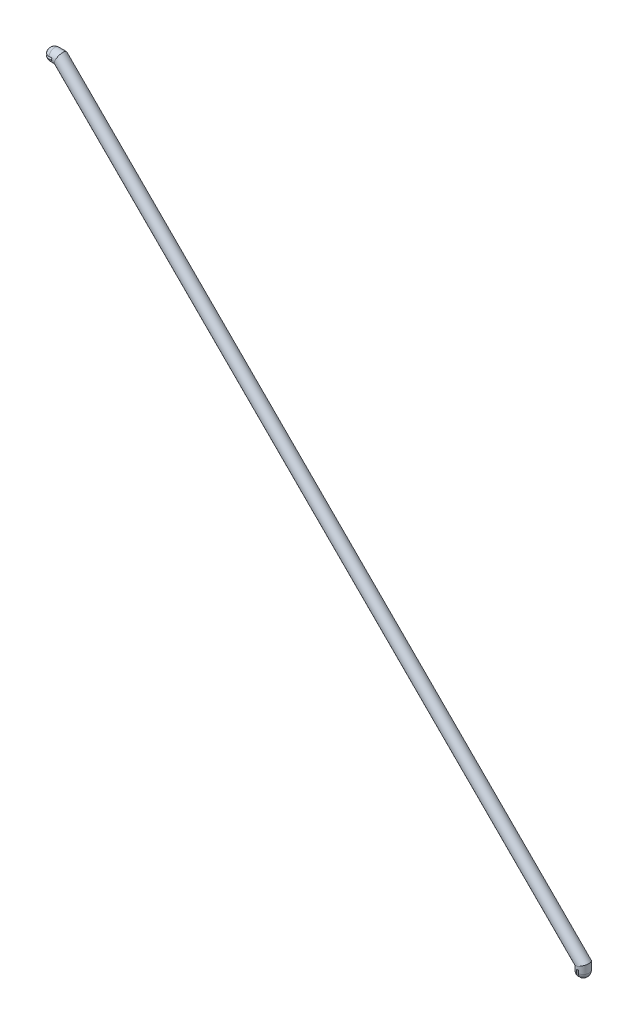
ISO-10303-21;
HEADER;
FILE_DESCRIPTION(('STEP AP214'),'2;1');
FILE_NAME('part.step','',(''),(''),'','','');
FILE_SCHEMA(('AUTOMOTIVE_DESIGN { 1 0 10303 214 1 1 1 1 }'));
ENDSEC;
DATA;
#1=APPLICATION_CONTEXT('core data for automotive mechanical design processes');
#2=APPLICATION_PROTOCOL_DEFINITION('international standard','automotive_design',2000,#1);
#3=PRODUCT_CONTEXT('',#1,'mechanical');
#4=PRODUCT('Part','Part','',(#3));
#5=PRODUCT_RELATED_PRODUCT_CATEGORY('part','',(#4));
#6=PRODUCT_DEFINITION_FORMATION('','',#4);
#7=PRODUCT_DEFINITION_CONTEXT('part definition',#1,'design');
#8=PRODUCT_DEFINITION('design','',#6,#7);
#9=PRODUCT_DEFINITION_SHAPE('','',#8);
#10=(LENGTH_UNIT() NAMED_UNIT(*) SI_UNIT(.MILLI.,.METRE.));
#11=(NAMED_UNIT(*) PLANE_ANGLE_UNIT() SI_UNIT($,.RADIAN.));
#12=(NAMED_UNIT(*) SI_UNIT($,.STERADIAN.) SOLID_ANGLE_UNIT());
#13=UNCERTAINTY_MEASURE_WITH_UNIT(LENGTH_MEASURE(1.E-05),#10,'distance_accuracy_value','');
#14=(GEOMETRIC_REPRESENTATION_CONTEXT(3) GLOBAL_UNCERTAINTY_ASSIGNED_CONTEXT((#13)) GLOBAL_UNIT_ASSIGNED_CONTEXT((#10,
#11,#12)) REPRESENTATION_CONTEXT('',''));
#15=CARTESIAN_POINT('',(0.,0.,0.));
#16=DIRECTION('',(0.,0.,1.));
#17=DIRECTION('',(1.,0.,0.));
#18=AXIS2_PLACEMENT_3D('',#15,#16,#17);
#19=CARTESIAN_POINT('',(-181.381279792797,177.381279792793,0.));
#20=DIRECTION('',(1.,0.,0.));
#21=DIRECTION('',(0.,1.,0.));
#22=AXIS2_PLACEMENT_3D('',#19,#20,#21);
#23=CYLINDRICAL_SURFACE('',#22,4.);
#24=CARTESIAN_POINT('',(-177.381279792798,177.381279792793,0.));
#25=DIRECTION('',(0.923879532511289,-0.382683432365085,0.));
#26=DIRECTION('',(0.382683432365085,0.923879532511289,0.));
#27=AXIS2_PLACEMENT_3D('',#24,#25,#26);
#28=ELLIPSE('',#27,4.32956880116954,4.);
#29=CARTESIAN_POINT('',(-175.724425543306,181.381279792793,0.));
#30=VERTEX_POINT('',#29);
#31=EDGE_CURVE('E163',#30,#30,#28,.T.);
#32=ORIENTED_EDGE('',*,*,#31,.F.);
#33=EDGE_LOOP('',(#32));
#34=FACE_BOUND('',#33,.T.);
#35=DIRECTION('',(1.,0.,0.));
#36=VECTOR('',#35,1.);
#37=CARTESIAN_POINT('',(-181.381279792797,178.131279792791,3.92905841137596));
#38=LINE('',#37,#36);
#39=CARTESIAN_POINT('',(-179.381279792798,178.131279792791,3.92905841137594));
#40=VERTEX_POINT('',#39);
#41=CARTESIAN_POINT('',(-181.381279792797,178.131279792791,3.92905841137569));
#42=VERTEX_POINT('',#41);
#43=EDGE_CURVE('E108',#40,#42,#38,.F.);
#44=ORIENTED_EDGE('',*,*,#43,.F.);
#45=CARTESIAN_POINT('',(-179.381279792798,177.381279792793,0.));
#46=DIRECTION('',(-1.,0.,0.));
#47=DIRECTION('',(0.,-1.,0.));
#48=AXIS2_PLACEMENT_3D('',#45,#46,#47);
#49=CIRCLE('',#48,4.);
#50=CARTESIAN_POINT('',(-179.381279792798,176.631279792791,3.92905841137492));
#51=VERTEX_POINT('',#50);
#52=EDGE_CURVE('E11',#51,#40,#49,.T.);
#53=ORIENTED_EDGE('',*,*,#52,.F.);
#54=DIRECTION('',(1.,0.,0.));
#55=VECTOR('',#54,1.);
#56=CARTESIAN_POINT('',(-181.381279792797,176.631279792791,3.9290584113749));
#57=LINE('',#56,#55);
#58=CARTESIAN_POINT('',(-181.381279792797,176.631279792791,3.92905841137517));
#59=VERTEX_POINT('',#58);
#60=EDGE_CURVE('E105',#59,#51,#57,.T.);
#61=ORIENTED_EDGE('',*,*,#60,.F.);
#62=CARTESIAN_POINT('',(-181.381279792797,177.381279792793,0.));
#63=DIRECTION('',(-1.,0.,0.));
#64=DIRECTION('',(0.,-1.,0.));
#65=AXIS2_PLACEMENT_3D('',#62,#63,#64);
#66=CIRCLE('',#65,4.);
#67=CARTESIAN_POINT('',(-181.381279792797,176.631279792791,-3.92905841137517));
#68=VERTEX_POINT('',#67);
#69=EDGE_CURVE('E159',#68,#59,#66,.T.);
#70=ORIENTED_EDGE('',*,*,#69,.F.);
#71=DIRECTION('',(1.,0.,0.));
#72=VECTOR('',#71,1.);
#73=CARTESIAN_POINT('',(-181.381279792797,176.631279792791,-3.9290584113749));
#74=LINE('',#73,#72);
#75=CARTESIAN_POINT('',(-179.381279792798,176.631279792791,-3.92905841137492));
#76=VERTEX_POINT('',#75);
#77=EDGE_CURVE('E52',#76,#68,#74,.F.);
#78=ORIENTED_EDGE('',*,*,#77,.F.);
#79=CARTESIAN_POINT('',(-179.381279792798,178.131279792791,-3.92905841137594));
#80=VERTEX_POINT('',#79);
#81=EDGE_CURVE('E45',#80,#76,#49,.T.);
#82=ORIENTED_EDGE('',*,*,#81,.F.);
#83=DIRECTION('',(1.,0.,0.));
#84=VECTOR('',#83,1.);
#85=CARTESIAN_POINT('',(-181.381279792797,178.131279792791,-3.92905841137596));
#86=LINE('',#85,#84);
#87=CARTESIAN_POINT('',(-181.381279792797,178.131279792791,-3.92905841137569));
#88=VERTEX_POINT('',#87);
#89=EDGE_CURVE('E126',#88,#80,#86,.T.);
#90=ORIENTED_EDGE('',*,*,#89,.F.);
#91=EDGE_CURVE('E161',#42,#88,#66,.T.);
#92=ORIENTED_EDGE('',*,*,#91,.F.);
#93=EDGE_LOOP('',(#44,#53,#61,#70,#78,#82,#90,#92));
#94=FACE_BOUND('',#93,.T.);
#95=ADVANCED_FACE('F36',(#34,#94),#23,.T.);
#96=CARTESIAN_POINT('',(-181.381279792798,177.381279792791,0.));
#97=DIRECTION('',(0.,0.,1.));
#98=DIRECTION('',(0.,-1.,0.));
#99=AXIS2_PLACEMENT_3D('',#96,#97,#98);
#100=SPHERICAL_SURFACE('',#99,4.);
#101=CARTESIAN_POINT('',(-181.381279792798,178.131279792791,0.));
#102=DIRECTION('',(0.,-1.,0.));
#103=DIRECTION('',(1.,0.,0.));
#104=AXIS2_PLACEMENT_3D('',#101,#102,#103);
#105=CIRCLE('',#104,3.92905841137543);
#106=EDGE_CURVE('E179',#42,#88,#105,.T.);
#107=ORIENTED_EDGE('',*,*,#106,.F.);
#108=ORIENTED_EDGE('',*,*,#91,.T.);
#109=EDGE_LOOP('',(#107,#108));
#110=FACE_BOUND('',#109,.T.);
#111=ADVANCED_FACE('F186',(#110),#100,.T.);
#112=CARTESIAN_POINT('',(-181.381279792798,176.631279792791,0.));
#113=DIRECTION('',(0.,1.,0.));
#114=DIRECTION('',(-1.,0.,0.));
#115=AXIS2_PLACEMENT_3D('',#112,#113,#114);
#116=CIRCLE('',#115,3.92905841137544);
#117=EDGE_CURVE('E115',#68,#59,#116,.T.);
#118=ORIENTED_EDGE('',*,*,#117,.F.);
#119=ORIENTED_EDGE('',*,*,#69,.T.);
#120=EDGE_LOOP('',(#118,#119));
#121=FACE_BOUND('',#120,.T.);
#122=ADVANCED_FACE('F188',(#121),#100,.T.);
#123=CARTESIAN_POINT('',(177.381279792799,-181.38127979279,0.));
#124=DIRECTION('',(0.,0.,1.));
#125=DIRECTION('',(-1.,0.,0.));
#126=AXIS2_PLACEMENT_3D('',#123,#124,#125);
#127=SPHERICAL_SURFACE('',#126,4.);
#128=CARTESIAN_POINT('',(177.381279792799,-181.38127979279,0.));
#129=DIRECTION('',(0.,1.,0.));
#130=DIRECTION('',(-1.,0.,0.));
#131=AXIS2_PLACEMENT_3D('',#128,#129,#130);
#132=CIRCLE('',#131,4.);
#133=CARTESIAN_POINT('',(178.131279792799,-181.38127979279,3.92905841137543));
#134=VERTEX_POINT('',#133);
#135=CARTESIAN_POINT('',(178.131279792799,-181.38127979279,-3.92905841137543));
#136=VERTEX_POINT('',#135);
#137=EDGE_CURVE('E158',#134,#136,#132,.T.);
#138=ORIENTED_EDGE('',*,*,#137,.F.);
#139=CARTESIAN_POINT('',(178.131279792799,-181.38127979279,0.));
#140=DIRECTION('',(1.,0.,0.));
#141=DIRECTION('',(0.,1.,0.));
#142=AXIS2_PLACEMENT_3D('',#139,#140,#141);
#143=CIRCLE('',#142,3.92905841137543);
#144=EDGE_CURVE('E170',#134,#136,#143,.T.);
#145=ORIENTED_EDGE('',*,*,#144,.T.);
#146=EDGE_LOOP('',(#138,#145));
#147=FACE_BOUND('',#146,.T.);
#148=ADVANCED_FACE('F194',(#147),#127,.T.);
#149=CARTESIAN_POINT('',(177.381279792799,-175.458740118349,0.));
#150=DIRECTION('',(0.,-1.,0.));
#151=DIRECTION('',(1.,0.,0.));
#152=AXIS2_PLACEMENT_3D('',#149,#150,#151);
#153=CYLINDRICAL_SURFACE('',#152,4.);
#154=CARTESIAN_POINT('',(177.381279792799,-179.38127979279,0.));
#155=DIRECTION('',(0.,-1.,0.));
#156=DIRECTION('',(0.,0.,-1.));
#157=AXIS2_PLACEMENT_3D('',#154,#155,#156);
#158=CIRCLE('',#157,4.);
#159=CARTESIAN_POINT('',(178.131279792799,-179.38127979279,3.92905841137542));
#160=VERTEX_POINT('',#159);
#161=CARTESIAN_POINT('',(176.631279792799,-179.38127979279,3.92905841137543));
#162=VERTEX_POINT('',#161);
#163=EDGE_CURVE('E175',#160,#162,#158,.T.);
#164=ORIENTED_EDGE('',*,*,#163,.F.);
#165=DIRECTION('',(0.,-1.,0.));
#166=VECTOR('',#165,1.);
#167=CARTESIAN_POINT('',(178.131279792799,-175.458740118349,3.92905841137543));
#168=LINE('',#167,#166);
#169=EDGE_CURVE('E152',#160,#134,#168,.T.);
#170=ORIENTED_EDGE('',*,*,#169,.T.);
#171=ORIENTED_EDGE('',*,*,#137,.T.);
#172=DIRECTION('',(0.,-1.,0.));
#173=VECTOR('',#172,1.);
#174=CARTESIAN_POINT('',(178.131279792799,-175.458740118349,-3.92905841137543));
#175=LINE('',#174,#173);
#176=CARTESIAN_POINT('',(178.131279792799,-179.38127979279,-3.92905841137542));
#177=VERTEX_POINT('',#176);
#178=EDGE_CURVE('E149',#136,#177,#175,.F.);
#179=ORIENTED_EDGE('',*,*,#178,.T.);
#180=CARTESIAN_POINT('',(176.631279792799,-179.38127979279,-3.92905841137543));
#181=VERTEX_POINT('',#180);
#182=EDGE_CURVE('E173',#181,#177,#158,.T.);
#183=ORIENTED_EDGE('',*,*,#182,.F.);
#184=DIRECTION('',(0.,-1.,0.));
#185=VECTOR('',#184,1.);
#186=CARTESIAN_POINT('',(176.631279792799,-175.458740118349,-3.92905841137543));
#187=LINE('',#186,#185);
#188=CARTESIAN_POINT('',(176.631279792799,-181.38127979279,-3.92905841137544));
#189=VERTEX_POINT('',#188);
#190=EDGE_CURVE('E146',#181,#189,#187,.T.);
#191=ORIENTED_EDGE('',*,*,#190,.T.);
#192=CARTESIAN_POINT('',(176.631279792799,-181.38127979279,3.92905841137544));
#193=VERTEX_POINT('',#192);
#194=EDGE_CURVE('E155',#189,#193,#132,.T.);
#195=ORIENTED_EDGE('',*,*,#194,.T.);
#196=DIRECTION('',(0.,-1.,0.));
#197=VECTOR('',#196,1.);
#198=CARTESIAN_POINT('',(176.631279792799,-175.458740118349,3.92905841137543));
#199=LINE('',#198,#197);
#200=EDGE_CURVE('E60',#193,#162,#199,.F.);
#201=ORIENTED_EDGE('',*,*,#200,.T.);
#202=EDGE_LOOP('',(#164,#170,#171,#179,#183,#191,#195,#201));
#203=FACE_BOUND('',#202,.T.);
#204=CARTESIAN_POINT('',(177.381279792799,-177.381279792791,0.));
#205=DIRECTION('',(0.382683432365097,-0.923879532511284,0.));
#206=DIRECTION('',(0.923879532511284,0.382683432365097,0.));
#207=AXIS2_PLACEMENT_3D('',#204,#205,#206);
#208=ELLIPSE('',#207,4.3295688011696,4.);
#209=CARTESIAN_POINT('',(181.381279792799,-175.724425543298,0.));
#210=VERTEX_POINT('',#209);
#211=EDGE_CURVE('E162',#210,#210,#208,.T.);
#212=ORIENTED_EDGE('',*,*,#211,.T.);
#213=EDGE_LOOP('',(#212));
#214=FACE_BOUND('',#213,.T.);
#215=ADVANCED_FACE('F38',(#203,#214),#153,.T.);
#216=CARTESIAN_POINT('',(-178.740720633697,178.740720633689,0.));
#217=DIRECTION('',(0.707106781186564,-0.707106781186531,0.));
#218=DIRECTION('',(0.707106781186531,0.707106781186564,0.));
#219=AXIS2_PLACEMENT_3D('',#216,#217,#218);
#220=CYLINDRICAL_SURFACE('',#219,4.);
#221=ORIENTED_EDGE('',*,*,#31,.T.);
#222=EDGE_LOOP('',(#221));
#223=FACE_BOUND('',#222,.T.);
#224=ORIENTED_EDGE('',*,*,#211,.F.);
#225=EDGE_LOOP('',(#224));
#226=FACE_BOUND('',#225,.T.);
#227=ADVANCED_FACE('F228',(#223,#226),#220,.T.);
#228=ORIENTED_EDGE('',*,*,#194,.F.);
#229=CARTESIAN_POINT('',(176.631279792799,-181.38127979279,0.));
#230=DIRECTION('',(-1.,0.,0.));
#231=DIRECTION('',(0.,-1.,0.));
#232=AXIS2_PLACEMENT_3D('',#229,#230,#231);
#233=CIRCLE('',#232,3.92905841137544);
#234=EDGE_CURVE('E166',#189,#193,#233,.T.);
#235=ORIENTED_EDGE('',*,*,#234,.T.);
#236=EDGE_LOOP('',(#228,#235));
#237=FACE_BOUND('',#236,.T.);
#238=ADVANCED_FACE('F219',(#237),#127,.T.);
#239=CARTESIAN_POINT('',(0.,-179.38127979279,0.));
#240=DIRECTION('',(0.,-1.,0.));
#241=DIRECTION('',(0.,0.,-1.));
#242=AXIS2_PLACEMENT_3D('',#239,#240,#241);
#243=PLANE('',#242);
#244=DIRECTION('',(0.,0.,1.));
#245=VECTOR('',#244,1.);
#246=CARTESIAN_POINT('',(178.131279792799,-179.38127979279,-4.));
#247=LINE('',#246,#245);
#248=EDGE_CURVE('E139',#177,#160,#247,.T.);
#249=ORIENTED_EDGE('',*,*,#248,.T.);
#250=ORIENTED_EDGE('',*,*,#163,.T.);
#251=DIRECTION('',(0.,0.,-1.));
#252=VECTOR('',#251,1.);
#253=CARTESIAN_POINT('',(176.631279792799,-179.38127979279,-4.));
#254=LINE('',#253,#252);
#255=EDGE_CURVE('E142',#162,#181,#254,.T.);
#256=ORIENTED_EDGE('',*,*,#255,.T.);
#257=ORIENTED_EDGE('',*,*,#182,.T.);
#258=EDGE_LOOP('',(#249,#250,#256,#257));
#259=FACE_BOUND('',#258,.T.);
#260=ADVANCED_FACE('F215',(#259),#243,.T.);
#261=CARTESIAN_POINT('',(178.131279792799,-179.38127979279,-4.));
#262=DIRECTION('',(1.,0.,0.));
#263=DIRECTION('',(0.,1.,0.));
#264=AXIS2_PLACEMENT_3D('',#261,#262,#263);
#265=PLANE('',#264);
#266=CARTESIAN_POINT('',(178.131279792799,-182.310338204165,0.));
#267=DIRECTION('',(1.,0.,0.));
#268=DIRECTION('',(0.,1.,0.));
#269=AXIS2_PLACEMENT_3D('',#266,#267,#268);
#270=CIRCLE('',#269,0.750000000000001);
#271=CARTESIAN_POINT('',(178.131279792799,-181.560338204165,0.));
#272=VERTEX_POINT('',#271);
#273=EDGE_CURVE('E136',#272,#272,#270,.F.);
#274=ORIENTED_EDGE('',*,*,#273,.F.);
#275=EDGE_LOOP('',(#274));
#276=FACE_BOUND('',#275,.T.);
#277=ORIENTED_EDGE('',*,*,#248,.F.);
#278=ORIENTED_EDGE('',*,*,#178,.F.);
#279=ORIENTED_EDGE('',*,*,#144,.F.);
#280=ORIENTED_EDGE('',*,*,#169,.F.);
#281=EDGE_LOOP('',(#277,#278,#279,#280));
#282=FACE_BOUND('',#281,.T.);
#283=ADVANCED_FACE('F218',(#276,#282),#265,.F.);
#284=CARTESIAN_POINT('',(176.631279792799,-179.38127979279,-4.));
#285=DIRECTION('',(-1.,0.,0.));
#286=DIRECTION('',(0.,-1.,0.));
#287=AXIS2_PLACEMENT_3D('',#284,#285,#286);
#288=PLANE('',#287);
#289=CARTESIAN_POINT('',(176.631279792799,-182.310338204165,0.));
#290=DIRECTION('',(-1.,0.,0.));
#291=DIRECTION('',(0.,-1.,0.));
#292=AXIS2_PLACEMENT_3D('',#289,#290,#291);
#293=CIRCLE('',#292,0.750000000000001);
#294=CARTESIAN_POINT('',(176.631279792799,-183.060338204165,0.));
#295=VERTEX_POINT('',#294);
#296=EDGE_CURVE('E135',#295,#295,#293,.F.);
#297=ORIENTED_EDGE('',*,*,#296,.F.);
#298=EDGE_LOOP('',(#297));
#299=FACE_BOUND('',#298,.T.);
#300=ORIENTED_EDGE('',*,*,#255,.F.);
#301=ORIENTED_EDGE('',*,*,#200,.F.);
#302=ORIENTED_EDGE('',*,*,#234,.F.);
#303=ORIENTED_EDGE('',*,*,#190,.F.);
#304=EDGE_LOOP('',(#300,#301,#302,#303));
#305=FACE_BOUND('',#304,.T.);
#306=ADVANCED_FACE('F205',(#299,#305),#288,.F.);
#307=CARTESIAN_POINT('',(175.881279792799,-182.310338204165,0.));
#308=DIRECTION('',(1.,0.,0.));
#309=DIRECTION('',(0.,1.,0.));
#310=AXIS2_PLACEMENT_3D('',#307,#308,#309);
#311=PLANE('',#310);
#312=CARTESIAN_POINT('',(175.881279792799,-182.310338204165,0.));
#313=DIRECTION('',(1.,0.,0.));
#314=DIRECTION('',(0.,1.,0.));
#315=AXIS2_PLACEMENT_3D('',#312,#313,#314);
#316=CIRCLE('',#315,0.750000000000001);
#317=CARTESIAN_POINT('',(175.881279792799,-181.560338204165,0.));
#318=VERTEX_POINT('',#317);
#319=EDGE_CURVE('E129',#318,#318,#316,.T.);
#320=ORIENTED_EDGE('',*,*,#319,.T.);
#321=EDGE_LOOP('',(#320));
#322=FACE_BOUND('',#321,.T.);
#323=ADVANCED_FACE('F201',(#322),#311,.T.);
#324=CARTESIAN_POINT('',(178.881279792799,-182.310338204165,0.));
#325=DIRECTION('',(-1.,0.,0.));
#326=DIRECTION('',(0.,-1.,0.));
#327=AXIS2_PLACEMENT_3D('',#324,#325,#326);
#328=CYLINDRICAL_SURFACE('',#327,0.750000000000001);
#329=ORIENTED_EDGE('',*,*,#319,.F.);
#330=EDGE_LOOP('',(#329));
#331=FACE_BOUND('',#330,.T.);
#332=ORIENTED_EDGE('',*,*,#296,.T.);
#333=EDGE_LOOP('',(#332));
#334=FACE_BOUND('',#333,.T.);
#335=ADVANCED_FACE('F204',(#331,#334),#328,.F.);
#336=CARTESIAN_POINT('',(178.881279792799,-182.310338204165,0.));
#337=DIRECTION('',(1.,0.,0.));
#338=DIRECTION('',(0.,1.,0.));
#339=AXIS2_PLACEMENT_3D('',#336,#337,#338);
#340=CIRCLE('',#339,0.750000000000001);
#341=CARTESIAN_POINT('',(178.881279792799,-181.560338204165,0.));
#342=VERTEX_POINT('',#341);
#343=EDGE_CURVE('E132',#342,#342,#340,.T.);
#344=ORIENTED_EDGE('',*,*,#343,.T.);
#345=EDGE_LOOP('',(#344));
#346=FACE_BOUND('',#345,.T.);
#347=ORIENTED_EDGE('',*,*,#273,.T.);
#348=EDGE_LOOP('',(#347));
#349=FACE_BOUND('',#348,.T.);
#350=ADVANCED_FACE('F210',(#346,#349),#328,.F.);
#351=CARTESIAN_POINT('',(178.881279792799,-182.310338204165,0.));
#352=DIRECTION('',(1.,0.,0.));
#353=DIRECTION('',(0.,1.,0.));
#354=AXIS2_PLACEMENT_3D('',#351,#352,#353);
#355=PLANE('',#354);
#356=ORIENTED_EDGE('',*,*,#343,.F.);
#357=EDGE_LOOP('',(#356));
#358=FACE_BOUND('',#357,.T.);
#359=ADVANCED_FACE('F207',(#358),#355,.F.);
#360=CARTESIAN_POINT('',(-179.38127979279,-8.42395945803155E-12,0.));
#361=DIRECTION('',(-1.,0.,0.));
#362=DIRECTION('',(0.,0.,-1.));
#363=AXIS2_PLACEMENT_3D('',#360,#361,#362);
#364=PLANE('',#363);
#365=DIRECTION('',(0.,0.,-1.));
#366=VECTOR('',#365,1.);
#367=CARTESIAN_POINT('',(-179.381279792798,176.631279792791,-4.));
#368=LINE('',#367,#366);
#369=EDGE_CURVE('E114',#51,#76,#368,.T.);
#370=ORIENTED_EDGE('',*,*,#369,.F.);
#371=ORIENTED_EDGE('',*,*,#52,.T.);
#372=DIRECTION('',(0.,0.,1.));
#373=VECTOR('',#372,1.);
#374=CARTESIAN_POINT('',(-179.381279792798,178.131279792791,-4.));
#375=LINE('',#374,#373);
#376=EDGE_CURVE('E118',#80,#40,#375,.T.);
#377=ORIENTED_EDGE('',*,*,#376,.F.);
#378=ORIENTED_EDGE('',*,*,#81,.T.);
#379=EDGE_LOOP('',(#370,#371,#377,#378));
#380=FACE_BOUND('',#379,.T.);
#381=ADVANCED_FACE('F117',(#380),#364,.T.);
#382=CARTESIAN_POINT('',(-179.381279792798,178.131279792791,-4.));
#383=DIRECTION('',(0.,-1.,0.));
#384=DIRECTION('',(1.,0.,0.));
#385=AXIS2_PLACEMENT_3D('',#382,#383,#384);
#386=PLANE('',#385);
#387=CARTESIAN_POINT('',(-182.310338204174,178.131279792791,0.));
#388=DIRECTION('',(0.,-1.,0.));
#389=DIRECTION('',(1.,0.,0.));
#390=AXIS2_PLACEMENT_3D('',#387,#388,#389);
#391=CIRCLE('',#390,0.750000000000001);
#392=CARTESIAN_POINT('',(-181.560338204174,178.131279792791,0.));
#393=VERTEX_POINT('',#392);
#394=EDGE_CURVE('E121',#393,#393,#391,.T.);
#395=ORIENTED_EDGE('',*,*,#394,.F.);
#396=EDGE_LOOP('',(#395));
#397=FACE_BOUND('',#396,.T.);
#398=ORIENTED_EDGE('',*,*,#89,.T.);
#399=ORIENTED_EDGE('',*,*,#376,.T.);
#400=ORIENTED_EDGE('',*,*,#43,.T.);
#401=ORIENTED_EDGE('',*,*,#106,.T.);
#402=EDGE_LOOP('',(#398,#399,#400,#401));
#403=FACE_BOUND('',#402,.T.);
#404=ADVANCED_FACE('F183',(#397,#403),#386,.T.);
#405=CARTESIAN_POINT('',(-179.381279792798,176.631279792791,-4.));
#406=DIRECTION('',(0.,1.,0.));
#407=DIRECTION('',(-1.,0.,0.));
#408=AXIS2_PLACEMENT_3D('',#405,#406,#407);
#409=PLANE('',#408);
#410=CARTESIAN_POINT('',(-182.310338204174,176.631279792791,0.));
#411=DIRECTION('',(0.,1.,0.));
#412=DIRECTION('',(-1.,0.,0.));
#413=AXIS2_PLACEMENT_3D('',#410,#411,#412);
#414=CIRCLE('',#413,0.750000000000001);
#415=CARTESIAN_POINT('',(-183.060338204174,176.631279792791,0.));
#416=VERTEX_POINT('',#415);
#417=EDGE_CURVE('E40',#416,#416,#414,.T.);
#418=ORIENTED_EDGE('',*,*,#417,.F.);
#419=EDGE_LOOP('',(#418));
#420=FACE_BOUND('',#419,.T.);
#421=ORIENTED_EDGE('',*,*,#60,.T.);
#422=ORIENTED_EDGE('',*,*,#369,.T.);
#423=ORIENTED_EDGE('',*,*,#77,.T.);
#424=ORIENTED_EDGE('',*,*,#117,.T.);
#425=EDGE_LOOP('',(#421,#422,#423,#424));
#426=FACE_BOUND('',#425,.T.);
#427=ADVANCED_FACE('F113',(#420,#426),#409,.T.);
#428=CARTESIAN_POINT('',(-182.310338204173,175.881279792791,0.));
#429=DIRECTION('',(0.,1.,0.));
#430=DIRECTION('',(1.,0.,0.));
#431=AXIS2_PLACEMENT_3D('',#428,#429,#430);
#432=PLANE('',#431);
#433=CARTESIAN_POINT('',(-182.310338204173,175.881279792791,0.));
#434=DIRECTION('',(0.,-1.,0.));
#435=DIRECTION('',(1.,0.,0.));
#436=AXIS2_PLACEMENT_3D('',#433,#434,#435);
#437=CIRCLE('',#436,0.750000000000001);
#438=CARTESIAN_POINT('',(-181.560338204173,175.881279792791,0.));
#439=VERTEX_POINT('',#438);
#440=EDGE_CURVE('E418',#439,#439,#437,.T.);
#441=ORIENTED_EDGE('',*,*,#440,.F.);
#442=EDGE_LOOP('',(#441));
#443=FACE_BOUND('',#442,.T.);
#444=ADVANCED_FACE('F359',(#443),#432,.T.);
#445=CARTESIAN_POINT('',(-182.310338204174,178.881279792791,0.));
#446=DIRECTION('',(0.,-1.,0.));
#447=DIRECTION('',(1.,0.,0.));
#448=AXIS2_PLACEMENT_3D('',#445,#446,#447);
#449=CYLINDRICAL_SURFACE('',#448,0.750000000000001);
#450=ORIENTED_EDGE('',*,*,#417,.T.);
#451=EDGE_LOOP('',(#450));
#452=FACE_BOUND('',#451,.T.);
#453=ORIENTED_EDGE('',*,*,#440,.T.);
#454=EDGE_LOOP('',(#453));
#455=FACE_BOUND('',#454,.T.);
#456=ADVANCED_FACE('F369',(#452,#455),#449,.F.);
#457=ORIENTED_EDGE('',*,*,#394,.T.);
#458=EDGE_LOOP('',(#457));
#459=FACE_BOUND('',#458,.T.);
#460=CARTESIAN_POINT('',(-182.310338204174,178.881279792791,0.));
#461=DIRECTION('',(0.,-1.,0.));
#462=DIRECTION('',(1.,0.,0.));
#463=AXIS2_PLACEMENT_3D('',#460,#461,#462);
#464=CIRCLE('',#463,0.750000000000001);
#465=CARTESIAN_POINT('',(-181.560338204174,178.881279792791,0.));
#466=VERTEX_POINT('',#465);
#467=EDGE_CURVE('E416',#466,#466,#464,.T.);
#468=ORIENTED_EDGE('',*,*,#467,.F.);
#469=EDGE_LOOP('',(#468));
#470=FACE_BOUND('',#469,.T.);
#471=ADVANCED_FACE('F380',(#459,#470),#449,.F.);
#472=CARTESIAN_POINT('',(-182.310338204174,178.881279792791,0.));
#473=DIRECTION('',(0.,1.,0.));
#474=DIRECTION('',(1.,0.,0.));
#475=AXIS2_PLACEMENT_3D('',#472,#473,#474);
#476=PLANE('',#475);
#477=ORIENTED_EDGE('',*,*,#467,.T.);
#478=EDGE_LOOP('',(#477));
#479=FACE_BOUND('',#478,.T.);
#480=ADVANCED_FACE('F391',(#479),#476,.F.);
#481=CLOSED_SHELL('',(#95,#111,#122,#148,#215,#227,#238,#260,#283,#306,#323,#335,#350,#359,#381,
#404,#427,#444,#456,#471,#480));
#482=MANIFOLD_SOLID_BREP('B2',#481);
#483=ADVANCED_BREP_SHAPE_REPRESENTATION('',(#18,#482),#14);
#484=SHAPE_DEFINITION_REPRESENTATION(#9,#483);
ENDSEC;
END-ISO-10303-21;
